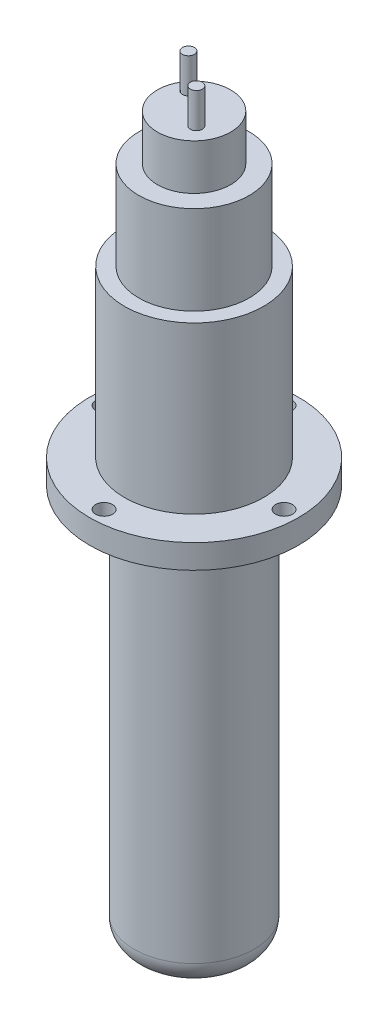
ISO-10303-21;
HEADER;
FILE_DESCRIPTION(('STEP AP214'),'2;1');
FILE_NAME('part.step','',(''),(''),'','','');
FILE_SCHEMA(('AUTOMOTIVE_DESIGN { 1 0 10303 214 1 1 1 1 }'));
ENDSEC;
DATA;
#1=APPLICATION_CONTEXT('core data for automotive mechanical design processes');
#2=APPLICATION_PROTOCOL_DEFINITION('international standard','automotive_design',2000,#1);
#3=PRODUCT_CONTEXT('',#1,'mechanical');
#4=PRODUCT('Part','Part','',(#3));
#5=PRODUCT_RELATED_PRODUCT_CATEGORY('part','',(#4));
#6=PRODUCT_DEFINITION_FORMATION('','',#4);
#7=PRODUCT_DEFINITION_CONTEXT('part definition',#1,'design');
#8=PRODUCT_DEFINITION('design','',#6,#7);
#9=PRODUCT_DEFINITION_SHAPE('','',#8);
#10=(LENGTH_UNIT() NAMED_UNIT(*) SI_UNIT(.MILLI.,.METRE.));
#11=(NAMED_UNIT(*) PLANE_ANGLE_UNIT() SI_UNIT($,.RADIAN.));
#12=(NAMED_UNIT(*) SI_UNIT($,.STERADIAN.) SOLID_ANGLE_UNIT());
#13=UNCERTAINTY_MEASURE_WITH_UNIT(LENGTH_MEASURE(1.E-05),#10,'distance_accuracy_value','');
#14=(GEOMETRIC_REPRESENTATION_CONTEXT(3) GLOBAL_UNCERTAINTY_ASSIGNED_CONTEXT((#13)) GLOBAL_UNIT_ASSIGNED_CONTEXT((#10,
#11,#12)) REPRESENTATION_CONTEXT('',''));
#15=CARTESIAN_POINT('',(0.,0.,0.));
#16=DIRECTION('',(0.,0.,1.));
#17=DIRECTION('',(1.,0.,0.));
#18=AXIS2_PLACEMENT_3D('',#15,#16,#17);
#19=CARTESIAN_POINT('',(0.,5.08,0.));
#20=DIRECTION('',(0.,-1.,0.));
#21=DIRECTION('',(0.,0.,-1.));
#22=AXIS2_PLACEMENT_3D('',#19,#20,#21);
#23=CYLINDRICAL_SURFACE('',#22,22.098);
#24=CARTESIAN_POINT('',(0.,5.08,0.));
#25=DIRECTION('',(0.,1.,0.));
#26=DIRECTION('',(0.,0.,1.));
#27=AXIS2_PLACEMENT_3D('',#24,#25,#26);
#28=CIRCLE('',#27,22.098);
#29=CARTESIAN_POINT('',(0.,5.08,22.098));
#30=VERTEX_POINT('',#29);
#31=EDGE_CURVE('E70',#30,#30,#28,.T.);
#32=ORIENTED_EDGE('',*,*,#31,.F.);
#33=EDGE_LOOP('',(#32));
#34=FACE_BOUND('',#33,.T.);
#35=CARTESIAN_POINT('',(0.,0.,0.));
#36=DIRECTION('',(0.,1.,0.));
#37=DIRECTION('',(0.,0.,1.));
#38=AXIS2_PLACEMENT_3D('',#35,#36,#37);
#39=CIRCLE('',#38,22.098);
#40=CARTESIAN_POINT('',(0.,0.,22.098));
#41=VERTEX_POINT('',#40);
#42=EDGE_CURVE('E67',#41,#41,#39,.T.);
#43=ORIENTED_EDGE('',*,*,#42,.T.);
#44=EDGE_LOOP('',(#43));
#45=FACE_BOUND('',#44,.T.);
#46=ADVANCED_FACE('F34',(#34,#45),#23,.T.);
#47=CARTESIAN_POINT('',(0.,5.08,0.));
#48=DIRECTION('',(0.,1.,0.));
#49=DIRECTION('',(0.,0.,1.));
#50=AXIS2_PLACEMENT_3D('',#47,#48,#49);
#51=PLANE('',#50);
#52=CARTESIAN_POINT('',(-19.05,5.08,0.));
#53=DIRECTION('',(0.,1.,0.));
#54=DIRECTION('',(1.,0.,0.));
#55=AXIS2_PLACEMENT_3D('',#52,#53,#54);
#56=CIRCLE('',#55,1.7907);
#57=CARTESIAN_POINT('',(-17.2593,5.08,0.));
#58=VERTEX_POINT('',#57);
#59=EDGE_CURVE('E62',#58,#58,#56,.T.);
#60=ORIENTED_EDGE('',*,*,#59,.F.);
#61=EDGE_LOOP('',(#60));
#62=FACE_BOUND('',#61,.T.);
#63=CARTESIAN_POINT('',(0.,5.08,19.05));
#64=DIRECTION('',(0.,1.,0.));
#65=DIRECTION('',(0.,0.,-1.));
#66=AXIS2_PLACEMENT_3D('',#63,#64,#65);
#67=CIRCLE('',#66,1.7907);
#68=CARTESIAN_POINT('',(0.,5.08,17.2593));
#69=VERTEX_POINT('',#68);
#70=EDGE_CURVE('E106',#69,#69,#67,.T.);
#71=ORIENTED_EDGE('',*,*,#70,.F.);
#72=EDGE_LOOP('',(#71));
#73=FACE_BOUND('',#72,.T.);
#74=CARTESIAN_POINT('',(19.05,5.08,-1.99538158514885E-13));
#75=DIRECTION('',(0.,1.,0.));
#76=DIRECTION('',(-1.,0.,0.));
#77=AXIS2_PLACEMENT_3D('',#74,#75,#76);
#78=CIRCLE('',#77,1.7907);
#79=CARTESIAN_POINT('',(17.2593,5.08,-1.80781571614486E-13));
#80=VERTEX_POINT('',#79);
#81=EDGE_CURVE('E103',#80,#80,#78,.T.);
#82=ORIENTED_EDGE('',*,*,#81,.F.);
#83=EDGE_LOOP('',(#82));
#84=FACE_BOUND('',#83,.T.);
#85=CARTESIAN_POINT('',(0.,5.08,-19.05));
#86=DIRECTION('',(0.,1.,0.));
#87=DIRECTION('',(0.,0.,1.));
#88=AXIS2_PLACEMENT_3D('',#85,#86,#87);
#89=CIRCLE('',#88,1.7907);
#90=CARTESIAN_POINT('',(0.,5.08,-17.2593));
#91=VERTEX_POINT('',#90);
#92=EDGE_CURVE('E55',#91,#91,#89,.T.);
#93=ORIENTED_EDGE('',*,*,#92,.F.);
#94=EDGE_LOOP('',(#93));
#95=FACE_BOUND('',#94,.T.);
#96=CARTESIAN_POINT('',(0.,5.08,0.));
#97=DIRECTION('',(0.,1.,0.));
#98=DIRECTION('',(0.,0.,1.));
#99=AXIS2_PLACEMENT_3D('',#96,#97,#98);
#100=CIRCLE('',#99,14.732);
#101=CARTESIAN_POINT('',(0.,5.08,14.732));
#102=VERTEX_POINT('',#101);
#103=EDGE_CURVE('E74',#102,#102,#100,.T.);
#104=ORIENTED_EDGE('',*,*,#103,.F.);
#105=EDGE_LOOP('',(#104));
#106=FACE_BOUND('',#105,.T.);
#107=ORIENTED_EDGE('',*,*,#31,.T.);
#108=EDGE_LOOP('',(#107));
#109=FACE_BOUND('',#108,.T.);
#110=ADVANCED_FACE('F115',(#62,#73,#84,#95,#106,#109),#51,.T.);
#111=CARTESIAN_POINT('',(0.,0.,0.));
#112=DIRECTION('',(0.,1.,0.));
#113=DIRECTION('',(0.,0.,1.));
#114=AXIS2_PLACEMENT_3D('',#111,#112,#113);
#115=PLANE('',#114);
#116=CARTESIAN_POINT('',(0.,0.,0.));
#117=DIRECTION('',(0.,1.,0.));
#118=DIRECTION('',(0.,0.,1.));
#119=AXIS2_PLACEMENT_3D('',#116,#117,#118);
#120=CIRCLE('',#119,12.7);
#121=CARTESIAN_POINT('',(0.,0.,12.7));
#122=VERTEX_POINT('',#121);
#123=EDGE_CURVE('E45',#122,#122,#120,.F.);
#124=ORIENTED_EDGE('',*,*,#123,.F.);
#125=EDGE_LOOP('',(#124));
#126=FACE_BOUND('',#125,.T.);
#127=CARTESIAN_POINT('',(-19.05,0.,0.));
#128=DIRECTION('',(0.,1.,0.));
#129=DIRECTION('',(0.,0.,1.));
#130=AXIS2_PLACEMENT_3D('',#127,#128,#129);
#131=CIRCLE('',#130,1.7907);
#132=CARTESIAN_POINT('',(-19.05,0.,1.79070000000007));
#133=VERTEX_POINT('',#132);
#134=EDGE_CURVE('E52',#133,#133,#131,.T.);
#135=ORIENTED_EDGE('',*,*,#134,.T.);
#136=EDGE_LOOP('',(#135));
#137=FACE_BOUND('',#136,.T.);
#138=CARTESIAN_POINT('',(0.,0.,19.05));
#139=DIRECTION('',(0.,1.,0.));
#140=DIRECTION('',(0.,0.,1.));
#141=AXIS2_PLACEMENT_3D('',#138,#139,#140);
#142=CIRCLE('',#141,1.7907);
#143=CARTESIAN_POINT('',(0.,0.,20.8407));
#144=VERTEX_POINT('',#143);
#145=EDGE_CURVE('E56',#144,#144,#142,.T.);
#146=ORIENTED_EDGE('',*,*,#145,.T.);
#147=EDGE_LOOP('',(#146));
#148=FACE_BOUND('',#147,.T.);
#149=CARTESIAN_POINT('',(19.05,0.,-1.99538158514885E-13));
#150=DIRECTION('',(0.,1.,0.));
#151=DIRECTION('',(0.,0.,1.));
#152=AXIS2_PLACEMENT_3D('',#149,#150,#151);
#153=CIRCLE('',#152,1.7907);
#154=CARTESIAN_POINT('',(19.05,0.,1.7906999999998));
#155=VERTEX_POINT('',#154);
#156=EDGE_CURVE('E59',#155,#155,#153,.T.);
#157=ORIENTED_EDGE('',*,*,#156,.T.);
#158=EDGE_LOOP('',(#157));
#159=FACE_BOUND('',#158,.T.);
#160=CARTESIAN_POINT('',(0.,0.,-19.05));
#161=DIRECTION('',(0.,1.,0.));
#162=DIRECTION('',(0.,0.,1.));
#163=AXIS2_PLACEMENT_3D('',#160,#161,#162);
#164=CIRCLE('',#163,1.7907);
#165=CARTESIAN_POINT('',(0.,0.,-17.2593));
#166=VERTEX_POINT('',#165);
#167=EDGE_CURVE('E63',#166,#166,#164,.T.);
#168=ORIENTED_EDGE('',*,*,#167,.T.);
#169=EDGE_LOOP('',(#168));
#170=FACE_BOUND('',#169,.T.);
#171=ORIENTED_EDGE('',*,*,#42,.F.);
#172=EDGE_LOOP('',(#171));
#173=FACE_BOUND('',#172,.T.);
#174=ADVANCED_FACE('F118',(#126,#137,#148,#159,#170,#173),#115,.F.);
#175=CARTESIAN_POINT('',(0.,40.132,0.));
#176=DIRECTION('',(0.,-1.,0.));
#177=DIRECTION('',(0.,0.,-1.));
#178=AXIS2_PLACEMENT_3D('',#175,#176,#177);
#179=CYLINDRICAL_SURFACE('',#178,14.732);
#180=CARTESIAN_POINT('',(0.,40.132,0.));
#181=DIRECTION('',(0.,1.,0.));
#182=DIRECTION('',(0.,0.,1.));
#183=AXIS2_PLACEMENT_3D('',#180,#181,#182);
#184=CIRCLE('',#183,14.732);
#185=CARTESIAN_POINT('',(0.,40.132,14.732));
#186=VERTEX_POINT('',#185);
#187=EDGE_CURVE('E71',#186,#186,#184,.T.);
#188=ORIENTED_EDGE('',*,*,#187,.F.);
#189=EDGE_LOOP('',(#188));
#190=FACE_BOUND('',#189,.T.);
#191=ORIENTED_EDGE('',*,*,#103,.T.);
#192=EDGE_LOOP('',(#191));
#193=FACE_BOUND('',#192,.T.);
#194=ADVANCED_FACE('F135',(#190,#193),#179,.T.);
#195=CARTESIAN_POINT('',(0.,40.132,0.));
#196=DIRECTION('',(0.,1.,0.));
#197=DIRECTION('',(0.,0.,1.));
#198=AXIS2_PLACEMENT_3D('',#195,#196,#197);
#199=PLANE('',#198);
#200=CARTESIAN_POINT('',(0.,40.132,0.));
#201=DIRECTION('',(0.,1.,0.));
#202=DIRECTION('',(0.,0.,1.));
#203=AXIS2_PLACEMENT_3D('',#200,#201,#202);
#204=CIRCLE('',#203,11.684);
#205=CARTESIAN_POINT('',(0.,40.132,11.684));
#206=VERTEX_POINT('',#205);
#207=EDGE_CURVE('E77',#206,#206,#204,.T.);
#208=ORIENTED_EDGE('',*,*,#207,.F.);
#209=EDGE_LOOP('',(#208));
#210=FACE_BOUND('',#209,.T.);
#211=ORIENTED_EDGE('',*,*,#187,.T.);
#212=EDGE_LOOP('',(#211));
#213=FACE_BOUND('',#212,.T.);
#214=ADVANCED_FACE('F141',(#210,#213),#199,.T.);
#215=CARTESIAN_POINT('',(0.,58.928,0.));
#216=DIRECTION('',(0.,-1.,0.));
#217=DIRECTION('',(0.,0.,-1.));
#218=AXIS2_PLACEMENT_3D('',#215,#216,#217);
#219=CYLINDRICAL_SURFACE('',#218,11.684);
#220=CARTESIAN_POINT('',(0.,58.928,0.));
#221=DIRECTION('',(0.,1.,0.));
#222=DIRECTION('',(0.,0.,1.));
#223=AXIS2_PLACEMENT_3D('',#220,#221,#222);
#224=CIRCLE('',#223,11.684);
#225=CARTESIAN_POINT('',(0.,58.928,11.684));
#226=VERTEX_POINT('',#225);
#227=EDGE_CURVE('E80',#226,#226,#224,.T.);
#228=ORIENTED_EDGE('',*,*,#227,.F.);
#229=EDGE_LOOP('',(#228));
#230=FACE_BOUND('',#229,.T.);
#231=ORIENTED_EDGE('',*,*,#207,.T.);
#232=EDGE_LOOP('',(#231));
#233=FACE_BOUND('',#232,.T.);
#234=ADVANCED_FACE('F149',(#230,#233),#219,.T.);
#235=CARTESIAN_POINT('',(0.,58.928,0.));
#236=DIRECTION('',(0.,1.,0.));
#237=DIRECTION('',(0.,0.,1.));
#238=AXIS2_PLACEMENT_3D('',#235,#236,#237);
#239=PLANE('',#238);
#240=CARTESIAN_POINT('',(0.,58.928,0.));
#241=DIRECTION('',(0.,1.,0.));
#242=DIRECTION('',(0.,0.,1.));
#243=AXIS2_PLACEMENT_3D('',#240,#241,#242);
#244=CIRCLE('',#243,7.747);
#245=CARTESIAN_POINT('',(0.,58.928,7.747));
#246=VERTEX_POINT('',#245);
#247=EDGE_CURVE('E49',#246,#246,#244,.T.);
#248=ORIENTED_EDGE('',*,*,#247,.F.);
#249=EDGE_LOOP('',(#248));
#250=FACE_BOUND('',#249,.T.);
#251=ORIENTED_EDGE('',*,*,#227,.T.);
#252=EDGE_LOOP('',(#251));
#253=FACE_BOUND('',#252,.T.);
#254=ADVANCED_FACE('F153',(#250,#253),#239,.T.);
#255=CARTESIAN_POINT('',(0.,68.58,0.));
#256=DIRECTION('',(0.,-1.,0.));
#257=DIRECTION('',(0.,0.,-1.));
#258=AXIS2_PLACEMENT_3D('',#255,#256,#257);
#259=CYLINDRICAL_SURFACE('',#258,7.747);
#260=CARTESIAN_POINT('',(0.,68.58,0.));
#261=DIRECTION('',(0.,1.,0.));
#262=DIRECTION('',(0.,0.,1.));
#263=AXIS2_PLACEMENT_3D('',#260,#261,#262);
#264=CIRCLE('',#263,7.747);
#265=CARTESIAN_POINT('',(0.,68.58,7.747));
#266=VERTEX_POINT('',#265);
#267=EDGE_CURVE('E85',#266,#266,#264,.T.);
#268=ORIENTED_EDGE('',*,*,#267,.F.);
#269=EDGE_LOOP('',(#268));
#270=FACE_BOUND('',#269,.T.);
#271=ORIENTED_EDGE('',*,*,#247,.T.);
#272=EDGE_LOOP('',(#271));
#273=FACE_BOUND('',#272,.T.);
#274=ADVANCED_FACE('F157',(#270,#273),#259,.T.);
#275=CARTESIAN_POINT('',(0.,68.58,0.));
#276=DIRECTION('',(0.,1.,0.));
#277=DIRECTION('',(0.,0.,1.));
#278=AXIS2_PLACEMENT_3D('',#275,#276,#277);
#279=PLANE('',#278);
#280=CARTESIAN_POINT('',(2.97002677292824,68.58,2.48175750236612));
#281=DIRECTION('',(0.,1.,0.));
#282=DIRECTION('',(0.,0.,1.));
#283=AXIS2_PLACEMENT_3D('',#280,#281,#282);
#284=CIRCLE('',#283,1.27);
#285=CARTESIAN_POINT('',(2.97002677292824,68.58,3.75175750236612));
#286=VERTEX_POINT('',#285);
#287=EDGE_CURVE('E66',#286,#286,#284,.T.);
#288=ORIENTED_EDGE('',*,*,#287,.F.);
#289=EDGE_LOOP('',(#288));
#290=FACE_BOUND('',#289,.T.);
#291=CARTESIAN_POINT('',(-4.24340631789732,68.58,-3.04439882199858));
#292=DIRECTION('',(0.,1.,0.));
#293=DIRECTION('',(0.,0.,1.));
#294=AXIS2_PLACEMENT_3D('',#291,#292,#293);
#295=CIRCLE('',#294,1.27);
#296=CARTESIAN_POINT('',(-4.24340631789732,68.58,-1.77439882199858));
#297=VERTEX_POINT('',#296);
#298=EDGE_CURVE('E91',#297,#297,#295,.T.);
#299=ORIENTED_EDGE('',*,*,#298,.F.);
#300=EDGE_LOOP('',(#299));
#301=FACE_BOUND('',#300,.T.);
#302=ORIENTED_EDGE('',*,*,#267,.T.);
#303=EDGE_LOOP('',(#302));
#304=FACE_BOUND('',#303,.T.);
#305=ADVANCED_FACE('F161',(#290,#301,#304),#279,.T.);
#306=CARTESIAN_POINT('',(-4.24340631789732,75.946,-3.04439882199858));
#307=DIRECTION('',(0.,-1.,0.));
#308=DIRECTION('',(0.,0.,-1.));
#309=AXIS2_PLACEMENT_3D('',#306,#307,#308);
#310=CYLINDRICAL_SURFACE('',#309,1.27);
#311=CARTESIAN_POINT('',(-4.24340631789732,75.946,-3.04439882199858));
#312=DIRECTION('',(0.,1.,0.));
#313=DIRECTION('',(0.,0.,1.));
#314=AXIS2_PLACEMENT_3D('',#311,#312,#313);
#315=CIRCLE('',#314,1.27);
#316=CARTESIAN_POINT('',(-4.24340631789732,75.946,-1.77439882199858));
#317=VERTEX_POINT('',#316);
#318=EDGE_CURVE('E90',#317,#317,#315,.T.);
#319=ORIENTED_EDGE('',*,*,#318,.F.);
#320=EDGE_LOOP('',(#319));
#321=FACE_BOUND('',#320,.T.);
#322=ORIENTED_EDGE('',*,*,#298,.T.);
#323=EDGE_LOOP('',(#322));
#324=FACE_BOUND('',#323,.T.);
#325=ADVANCED_FACE('F165',(#321,#324),#310,.T.);
#326=CARTESIAN_POINT('',(-4.24340631789732,75.946,-3.04439882199858));
#327=DIRECTION('',(0.,1.,0.));
#328=DIRECTION('',(0.,0.,1.));
#329=AXIS2_PLACEMENT_3D('',#326,#327,#328);
#330=PLANE('',#329);
#331=ORIENTED_EDGE('',*,*,#318,.T.);
#332=EDGE_LOOP('',(#331));
#333=FACE_BOUND('',#332,.T.);
#334=ADVANCED_FACE('F169',(#333),#330,.T.);
#335=CARTESIAN_POINT('',(2.97002677292824,75.946,2.48175750236612));
#336=DIRECTION('',(0.,-1.,0.));
#337=DIRECTION('',(0.,0.,-1.));
#338=AXIS2_PLACEMENT_3D('',#335,#336,#337);
#339=CYLINDRICAL_SURFACE('',#338,1.27);
#340=CARTESIAN_POINT('',(2.97002677292824,75.946,2.48175750236612));
#341=DIRECTION('',(0.,1.,0.));
#342=DIRECTION('',(0.,0.,1.));
#343=AXIS2_PLACEMENT_3D('',#340,#341,#342);
#344=CIRCLE('',#343,1.27);
#345=CARTESIAN_POINT('',(2.97002677292824,75.946,3.75175750236612));
#346=VERTEX_POINT('',#345);
#347=EDGE_CURVE('E94',#346,#346,#344,.T.);
#348=ORIENTED_EDGE('',*,*,#347,.F.);
#349=EDGE_LOOP('',(#348));
#350=FACE_BOUND('',#349,.T.);
#351=ORIENTED_EDGE('',*,*,#287,.T.);
#352=EDGE_LOOP('',(#351));
#353=FACE_BOUND('',#352,.T.);
#354=ADVANCED_FACE('F173',(#350,#353),#339,.T.);
#355=CARTESIAN_POINT('',(2.97002677292824,75.946,2.48175750236612));
#356=DIRECTION('',(0.,1.,0.));
#357=DIRECTION('',(0.,0.,1.));
#358=AXIS2_PLACEMENT_3D('',#355,#356,#357);
#359=PLANE('',#358);
#360=ORIENTED_EDGE('',*,*,#347,.T.);
#361=EDGE_LOOP('',(#360));
#362=FACE_BOUND('',#361,.T.);
#363=ADVANCED_FACE('F177',(#362),#359,.T.);
#364=CARTESIAN_POINT('',(0.,-2.286,-19.05));
#365=DIRECTION('',(0.,1.,0.));
#366=DIRECTION('',(0.,0.,1.));
#367=AXIS2_PLACEMENT_3D('',#364,#365,#366);
#368=CYLINDRICAL_SURFACE('',#367,1.7907);
#369=ORIENTED_EDGE('',*,*,#92,.T.);
#370=EDGE_LOOP('',(#369));
#371=FACE_BOUND('',#370,.T.);
#372=ORIENTED_EDGE('',*,*,#167,.F.);
#373=EDGE_LOOP('',(#372));
#374=FACE_BOUND('',#373,.T.);
#375=ADVANCED_FACE('F181',(#371,#374),#368,.F.);
#376=CARTESIAN_POINT('',(19.05,-2.286,-1.99538158514885E-13));
#377=DIRECTION('',(0.,1.,0.));
#378=DIRECTION('',(0.,0.,1.));
#379=AXIS2_PLACEMENT_3D('',#376,#377,#378);
#380=CYLINDRICAL_SURFACE('',#379,1.7907);
#381=ORIENTED_EDGE('',*,*,#81,.T.);
#382=EDGE_LOOP('',(#381));
#383=FACE_BOUND('',#382,.T.);
#384=ORIENTED_EDGE('',*,*,#156,.F.);
#385=EDGE_LOOP('',(#384));
#386=FACE_BOUND('',#385,.T.);
#387=ADVANCED_FACE('F185',(#383,#386),#380,.F.);
#388=CARTESIAN_POINT('',(0.,-2.286,19.05));
#389=DIRECTION('',(0.,1.,0.));
#390=DIRECTION('',(0.,0.,1.));
#391=AXIS2_PLACEMENT_3D('',#388,#389,#390);
#392=CYLINDRICAL_SURFACE('',#391,1.7907);
#393=ORIENTED_EDGE('',*,*,#70,.T.);
#394=EDGE_LOOP('',(#393));
#395=FACE_BOUND('',#394,.T.);
#396=ORIENTED_EDGE('',*,*,#145,.F.);
#397=EDGE_LOOP('',(#396));
#398=FACE_BOUND('',#397,.T.);
#399=ADVANCED_FACE('F189',(#395,#398),#392,.F.);
#400=CARTESIAN_POINT('',(-19.05,-2.286,0.));
#401=DIRECTION('',(0.,1.,0.));
#402=DIRECTION('',(0.,0.,1.));
#403=AXIS2_PLACEMENT_3D('',#400,#401,#402);
#404=CYLINDRICAL_SURFACE('',#403,1.7907);
#405=ORIENTED_EDGE('',*,*,#59,.T.);
#406=EDGE_LOOP('',(#405));
#407=FACE_BOUND('',#406,.T.);
#408=ORIENTED_EDGE('',*,*,#134,.F.);
#409=EDGE_LOOP('',(#408));
#410=FACE_BOUND('',#409,.T.);
#411=ADVANCED_FACE('F112',(#407,#410),#404,.F.);
#412=CARTESIAN_POINT('',(0.,-83.82,0.));
#413=DIRECTION('',(0.,1.,0.));
#414=DIRECTION('',(0.,0.,1.));
#415=AXIS2_PLACEMENT_3D('',#412,#413,#414);
#416=CYLINDRICAL_SURFACE('',#415,12.7);
#417=CARTESIAN_POINT('',(0.,-78.74,0.));
#418=DIRECTION('',(0.,-1.,0.));
#419=DIRECTION('',(0.,0.,-1.));
#420=AXIS2_PLACEMENT_3D('',#417,#418,#419);
#421=CIRCLE('',#420,12.7);
#422=CARTESIAN_POINT('',(0.,-78.74,-12.7));
#423=VERTEX_POINT('',#422);
#424=EDGE_CURVE('E10',#423,#423,#421,.F.);
#425=ORIENTED_EDGE('',*,*,#424,.T.);
#426=EDGE_LOOP('',(#425));
#427=FACE_BOUND('',#426,.T.);
#428=ORIENTED_EDGE('',*,*,#123,.T.);
#429=EDGE_LOOP('',(#428));
#430=FACE_BOUND('',#429,.T.);
#431=ADVANCED_FACE('F196',(#427,#430),#416,.T.);
#432=CARTESIAN_POINT('',(0.,-83.82,0.));
#433=DIRECTION('',(0.,-1.,0.));
#434=DIRECTION('',(0.,0.,-1.));
#435=AXIS2_PLACEMENT_3D('',#432,#433,#434);
#436=PLANE('',#435);
#437=CARTESIAN_POINT('',(0.,-83.82,0.));
#438=DIRECTION('',(0.,-1.,0.));
#439=DIRECTION('',(0.,0.,-1.));
#440=AXIS2_PLACEMENT_3D('',#437,#438,#439);
#441=CIRCLE('',#440,7.62);
#442=CARTESIAN_POINT('',(0.,-83.82,-7.62));
#443=VERTEX_POINT('',#442);
#444=EDGE_CURVE('E41',#443,#443,#441,.T.);
#445=ORIENTED_EDGE('',*,*,#444,.T.);
#446=EDGE_LOOP('',(#445));
#447=FACE_BOUND('',#446,.T.);
#448=ADVANCED_FACE('F199',(#447),#436,.T.);
#449=CARTESIAN_POINT('',(0.,-78.74,0.));
#450=DIRECTION('',(0.,-1.,0.));
#451=DIRECTION('',(0.,0.,-1.));
#452=AXIS2_PLACEMENT_3D('',#449,#450,#451);
#453=TOROIDAL_SURFACE('',#452,7.62,5.08);
#454=ORIENTED_EDGE('',*,*,#424,.F.);
#455=EDGE_LOOP('',(#454));
#456=FACE_BOUND('',#455,.T.);
#457=ORIENTED_EDGE('',*,*,#444,.F.);
#458=EDGE_LOOP('',(#457));
#459=FACE_BOUND('',#458,.T.);
#460=ADVANCED_FACE('F36',(#456,#459),#453,.T.);
#461=CLOSED_SHELL('',(#46,#110,#174,#194,#214,#234,#254,#274,#305,#325,#334,#354,#363,#375,#387,
#399,#411,#431,#448,#460));
#462=MANIFOLD_SOLID_BREP('B2',#461);
#463=ADVANCED_BREP_SHAPE_REPRESENTATION('',(#18,#462),#14);
#464=SHAPE_DEFINITION_REPRESENTATION(#9,#463);
ENDSEC;
END-ISO-10303-21;
